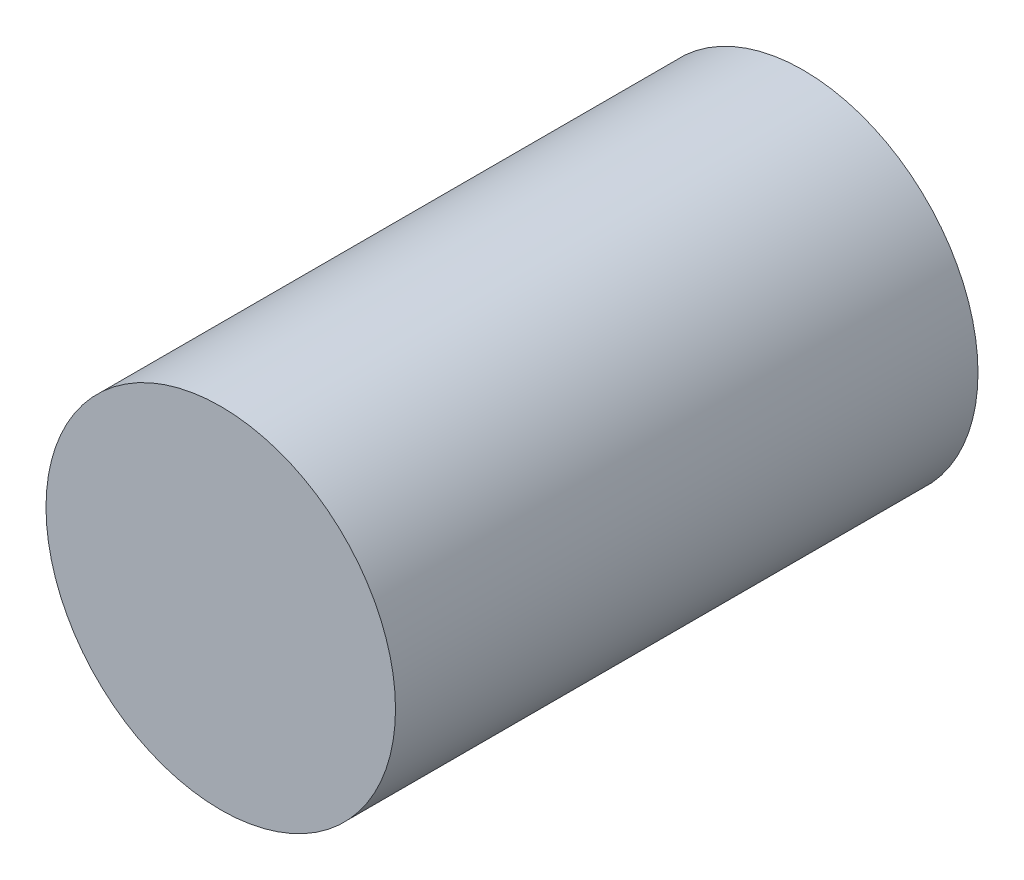
ISO-10303-21;
HEADER;
FILE_DESCRIPTION(('STEP AP214'),'2;1');
FILE_NAME('part.step','',(''),(''),'','','');
FILE_SCHEMA(('AUTOMOTIVE_DESIGN { 1 0 10303 214 1 1 1 1 }'));
ENDSEC;
DATA;
#1=APPLICATION_CONTEXT('core data for automotive mechanical design processes');
#2=APPLICATION_PROTOCOL_DEFINITION('international standard','automotive_design',2000,#1);
#3=PRODUCT_CONTEXT('',#1,'mechanical');
#4=PRODUCT('Part','Part','',(#3));
#5=PRODUCT_RELATED_PRODUCT_CATEGORY('part','',(#4));
#6=PRODUCT_DEFINITION_FORMATION('','',#4);
#7=PRODUCT_DEFINITION_CONTEXT('part definition',#1,'design');
#8=PRODUCT_DEFINITION('design','',#6,#7);
#9=PRODUCT_DEFINITION_SHAPE('','',#8);
#10=(LENGTH_UNIT() NAMED_UNIT(*) SI_UNIT(.MILLI.,.METRE.));
#11=(NAMED_UNIT(*) PLANE_ANGLE_UNIT() SI_UNIT($,.RADIAN.));
#12=(NAMED_UNIT(*) SI_UNIT($,.STERADIAN.) SOLID_ANGLE_UNIT());
#13=UNCERTAINTY_MEASURE_WITH_UNIT(LENGTH_MEASURE(1.E-05),#10,'distance_accuracy_value','');
#14=(GEOMETRIC_REPRESENTATION_CONTEXT(3) GLOBAL_UNCERTAINTY_ASSIGNED_CONTEXT((#13)) GLOBAL_UNIT_ASSIGNED_CONTEXT((#10,
#11,#12)) REPRESENTATION_CONTEXT('',''));
#15=CARTESIAN_POINT('',(0.,0.,0.));
#16=DIRECTION('',(0.,0.,1.));
#17=DIRECTION('',(1.,0.,0.));
#18=AXIS2_PLACEMENT_3D('',#15,#16,#17);
#19=CARTESIAN_POINT('',(0.,0.,5.));
#20=DIRECTION('',(0.,0.,-1.));
#21=DIRECTION('',(-1.,0.,0.));
#22=AXIS2_PLACEMENT_3D('',#19,#20,#21);
#23=CYLINDRICAL_SURFACE('',#22,1.5);
#24=CARTESIAN_POINT('',(0.,0.,5.));
#25=DIRECTION('',(0.,0.,1.));
#26=DIRECTION('',(1.,0.,0.));
#27=AXIS2_PLACEMENT_3D('',#24,#25,#26);
#28=CIRCLE('',#27,1.5);
#29=CARTESIAN_POINT('',(1.5,0.,5.));
#30=VERTEX_POINT('',#29);
#31=EDGE_CURVE('E10',#30,#30,#28,.T.);
#32=ORIENTED_EDGE('',*,*,#31,.F.);
#33=EDGE_LOOP('',(#32));
#34=FACE_BOUND('',#33,.T.);
#35=CARTESIAN_POINT('',(0.,0.,0.));
#36=DIRECTION('',(0.,0.,1.));
#37=DIRECTION('',(1.,0.,0.));
#38=AXIS2_PLACEMENT_3D('',#35,#36,#37);
#39=CIRCLE('',#38,1.5);
#40=CARTESIAN_POINT('',(1.5,0.,0.));
#41=VERTEX_POINT('',#40);
#42=EDGE_CURVE('E40',#41,#41,#39,.T.);
#43=ORIENTED_EDGE('',*,*,#42,.T.);
#44=EDGE_LOOP('',(#43));
#45=FACE_BOUND('',#44,.T.);
#46=ADVANCED_FACE('F37',(#34,#45),#23,.T.);
#47=CARTESIAN_POINT('',(0.,0.,5.));
#48=DIRECTION('',(0.,0.,1.));
#49=DIRECTION('',(1.,0.,0.));
#50=AXIS2_PLACEMENT_3D('',#47,#48,#49);
#51=PLANE('',#50);
#52=ORIENTED_EDGE('',*,*,#31,.T.);
#53=EDGE_LOOP('',(#52));
#54=FACE_BOUND('',#53,.T.);
#55=ADVANCED_FACE('F54',(#54),#51,.T.);
#56=CARTESIAN_POINT('',(0.,0.,0.));
#57=DIRECTION('',(0.,0.,1.));
#58=DIRECTION('',(1.,0.,0.));
#59=AXIS2_PLACEMENT_3D('',#56,#57,#58);
#60=PLANE('',#59);
#61=ORIENTED_EDGE('',*,*,#42,.F.);
#62=EDGE_LOOP('',(#61));
#63=FACE_BOUND('',#62,.T.);
#64=ADVANCED_FACE('F52',(#63),#60,.F.);
#65=CLOSED_SHELL('',(#46,#55,#64));
#66=MANIFOLD_SOLID_BREP('B2',#65);
#67=ADVANCED_BREP_SHAPE_REPRESENTATION('',(#18,#66),#14);
#68=SHAPE_DEFINITION_REPRESENTATION(#9,#67);
ENDSEC;
END-ISO-10303-21;
